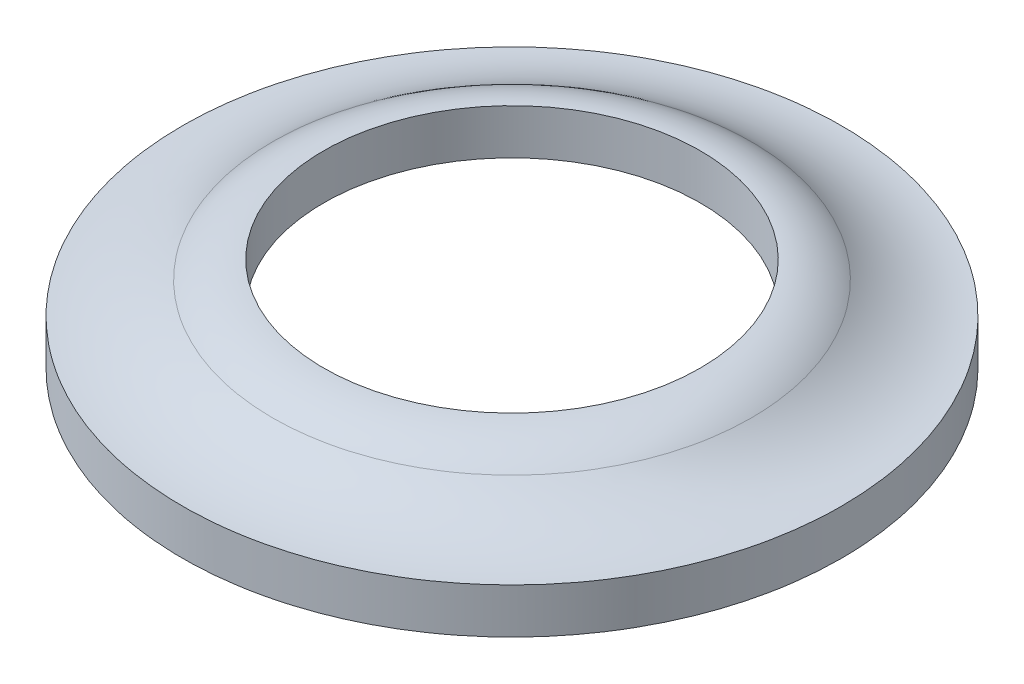
ISO-10303-21;
HEADER;
FILE_DESCRIPTION(('STEP AP214'),'2;1');
FILE_NAME('part.step','',(''),(''),'','','');
FILE_SCHEMA(('AUTOMOTIVE_DESIGN { 1 0 10303 214 1 1 1 1 }'));
ENDSEC;
DATA;
#1=APPLICATION_CONTEXT('core data for automotive mechanical design processes');
#2=APPLICATION_PROTOCOL_DEFINITION('international standard','automotive_design',2000,#1);
#3=PRODUCT_CONTEXT('',#1,'mechanical');
#4=PRODUCT('Part','Part','',(#3));
#5=PRODUCT_RELATED_PRODUCT_CATEGORY('part','',(#4));
#6=PRODUCT_DEFINITION_FORMATION('','',#4);
#7=PRODUCT_DEFINITION_CONTEXT('part definition',#1,'design');
#8=PRODUCT_DEFINITION('design','',#6,#7);
#9=PRODUCT_DEFINITION_SHAPE('','',#8);
#10=(LENGTH_UNIT() NAMED_UNIT(*) SI_UNIT(.MILLI.,.METRE.));
#11=(NAMED_UNIT(*) PLANE_ANGLE_UNIT() SI_UNIT($,.RADIAN.));
#12=(NAMED_UNIT(*) SI_UNIT($,.STERADIAN.) SOLID_ANGLE_UNIT());
#13=UNCERTAINTY_MEASURE_WITH_UNIT(LENGTH_MEASURE(1.E-05),#10,'distance_accuracy_value','');
#14=(GEOMETRIC_REPRESENTATION_CONTEXT(3) GLOBAL_UNCERTAINTY_ASSIGNED_CONTEXT((#13)) GLOBAL_UNIT_ASSIGNED_CONTEXT((#10,
#11,#12)) REPRESENTATION_CONTEXT('',''));
#15=CARTESIAN_POINT('',(0.,0.,0.));
#16=DIRECTION('',(0.,0.,1.));
#17=DIRECTION('',(1.,0.,0.));
#18=AXIS2_PLACEMENT_3D('',#15,#16,#17);
#19=CARTESIAN_POINT('',(1.78174892874158,0.34541037136962,0.));
#20=CARTESIAN_POINT('',(1.7817489287416,0.34541037136962,0.233230384341726));
#21=CARTESIAN_POINT('',(1.73537477134997,0.34541037136962,0.466369017210713));
#22=CARTESIAN_POINT('',(1.55686796332652,0.345410371369634,0.89732257411658));
#23=CARTESIAN_POINT('',(1.42480553623185,0.345410371369648,1.09496796353806));
#24=CARTESIAN_POINT('',(1.0949679635383,0.345410371369592,1.42480553623169));
#25=CARTESIAN_POINT('',(0.897322574116698,0.345410371369648,1.55686796332644));
#26=CARTESIAN_POINT('',(0.466369017210727,0.345410371369592,1.73537477134984));
#27=CARTESIAN_POINT('',(0.233230384341837,0.345410371369731,1.78174892874153));
#28=CARTESIAN_POINT('',(-0.233230384341497,0.345410371369731,1.78174892874158));
#29=CARTESIAN_POINT('',(-0.466369017210394,0.345410371369703,1.73537477134983));
#30=CARTESIAN_POINT('',(-0.897322574116413,0.345410371369703,1.55686796332639));
#31=CARTESIAN_POINT('',(-1.0949679635381,0.345410371369648,1.42480553623175));
#32=CARTESIAN_POINT('',(-1.42480553623146,0.345410371369648,1.09496796353832));
#33=CARTESIAN_POINT('',(-1.55686796332632,0.345410371369717,0.897322574116607));
#34=CARTESIAN_POINT('',(-1.73537477134975,0.345410371369551,0.466369017210574));
#35=CARTESIAN_POINT('',(-1.78174892874129,0.345410371369551,0.233230384341754));
#36=CARTESIAN_POINT('',(-1.78174892874132,0.345410371369551,-0.233230384341587));
#37=CARTESIAN_POINT('',(-1.73537477134969,0.345410371369578,-0.466369017210644));
#38=CARTESIAN_POINT('',(-1.55686796332631,0.345410371369537,-0.897322574116607));
#39=CARTESIAN_POINT('',(-1.42480553623159,0.345410371369537,-1.09496796353824));
#40=CARTESIAN_POINT('',(-1.09496796353814,0.345410371369564,-1.42480553623157));
#41=CARTESIAN_POINT('',(-0.897322574116483,0.34541037136962,-1.55686796332641));
#42=CARTESIAN_POINT('',(-0.466369017210512,0.345410371369523,-1.73537477134993));
#43=CARTESIAN_POINT('',(-0.233230384341546,0.345410371369523,-1.7817489287415));
#44=CARTESIAN_POINT('',(0.233230384341698,0.345410371369523,-1.78174892874156));
#45=CARTESIAN_POINT('',(0.466369017210769,0.345410371369509,-1.73537477135004));
#46=CARTESIAN_POINT('',(0.897322574116816,0.345410371369537,-1.55686796332649));
#47=CARTESIAN_POINT('',(1.09496796353824,0.345410371369606,-1.42480553623169));
#48=CARTESIAN_POINT('',(1.42480553623185,0.345410371369648,-1.09496796353817));
#49=CARTESIAN_POINT('',(1.55686796332663,0.345410371369606,-0.897322574116607));
#50=CARTESIAN_POINT('',(1.73537477135,0.345410371369648,-0.466369017210588));
#51=CARTESIAN_POINT('',(1.78174892874157,0.34541037136962,-0.23323038434174));
#52=CARTESIAN_POINT('',(1.78174892874158,0.34541037136962,0.));
#53=CARTESIAN_POINT('',(2.22006583333348,0.,-1.10160267699312E-13));
#54=CARTESIAN_POINT('',(2.22006583333341,0.,0.290605931744742));
#55=CARTESIAN_POINT('',(2.1622834596703,0.,0.581097540811106));
#56=CARTESIAN_POINT('',(1.93986330881861,-1.39536339085795E-13,1.11806728554163));
#57=CARTESIAN_POINT('',(1.77531303042039,0.,1.36433418044068));
#58=CARTESIAN_POINT('',(1.36433418044109,1.24848303392553E-13,1.77531303042039));
#59=CARTESIAN_POINT('',(1.11806728554205,1.10160267699312E-13,1.93986330881858));
#60=CARTESIAN_POINT('',(0.581097540811268,-1.24848303392553E-13,2.16228345966978));
#61=CARTESIAN_POINT('',(0.290605931744904,-1.10160267699312E-13,2.22006583333324));
#62=CARTESIAN_POINT('',(-0.290605931744566,0.,2.22006583333316));
#63=CARTESIAN_POINT('',(-0.581097540810967,0.,2.16228345966994));
#64=CARTESIAN_POINT('',(-1.11806728554155,0.,1.93986330881855));
#65=CARTESIAN_POINT('',(-1.36433418044093,1.17504285545932E-13,1.77531303042026));
#66=CARTESIAN_POINT('',(-1.77531303042012,0.,1.36433418044065));
#67=CARTESIAN_POINT('',(-1.93986330881846,0.,1.11806728554175));
#68=CARTESIAN_POINT('',(-2.16228345966994,0.,0.581097540811033));
#69=CARTESIAN_POINT('',(-2.22006583333318,0.,0.29060593174461));
#70=CARTESIAN_POINT('',(-2.22006583333326,0.,-0.290605931744816));
#71=CARTESIAN_POINT('',(-2.16228345966983,0.,-0.581097540811121));
#72=CARTESIAN_POINT('',(-1.93986330881854,0.,-1.11806728554192));
#73=CARTESIAN_POINT('',(-1.77531303042013,1.02816249852691E-13,-1.36433418044101));
#74=CARTESIAN_POINT('',(-1.36433418044093,-1.24848303392553E-13,-1.77531303042056));
#75=CARTESIAN_POINT('',(-1.11806728554167,0.,-1.93986330881872));
#76=CARTESIAN_POINT('',(-0.581097540810886,0.,-2.16228345967011));
#77=CARTESIAN_POINT('',(-0.29060593174461,0.,-2.22006583333347));
#78=CARTESIAN_POINT('',(0.290605931744963,0.,-2.22006583333341));
#79=CARTESIAN_POINT('',(0.581097540811444,0.,-2.16228345967038));
#80=CARTESIAN_POINT('',(1.11806728554195,0.,-1.9398633088184));
#81=CARTESIAN_POINT('',(1.36433418044096,1.54224374779036E-13,-1.77531303042056));
#82=CARTESIAN_POINT('',(1.77531303042035,0.,-1.36433418044087));
#83=CARTESIAN_POINT('',(1.93986330881872,0.,-1.11806728554186));
#84=CARTESIAN_POINT('',(2.16228345967022,0.,-0.581097540811253));
#85=CARTESIAN_POINT('',(2.22006583333356,0.,-0.290605931744963));
#86=CARTESIAN_POINT('',(2.22006583333348,0.,-1.10160267699312E-13));
#87=CARTESIAN_POINT('',(2.77812500000008,0.,0.));
#88=CARTESIAN_POINT('',(2.77812500000014,0.,0.363655704261862));
#89=CARTESIAN_POINT('',(2.70581783936397,0.,0.727168348490806));
#90=CARTESIAN_POINT('',(2.42748781315211,0.,1.39911647258782));
#91=CARTESIAN_POINT('',(2.22157444098461,0.,1.70728761198309));
#92=CARTESIAN_POINT('',(1.70728761198323,0.,2.22157444098457));
#93=CARTESIAN_POINT('',(1.39911647258784,0.,2.42748781315183));
#94=CARTESIAN_POINT('',(0.727168348490917,0.,2.70581783936387));
#95=CARTESIAN_POINT('',(0.363655704261834,0.,2.77812499999991));
#96=CARTESIAN_POINT('',(-0.363655704261653,0.,2.77812500000001));
#97=CARTESIAN_POINT('',(-0.727168348490605,0.,2.70581783936402));
#98=CARTESIAN_POINT('',(-1.39911647258757,0.,2.42748781315195));
#99=CARTESIAN_POINT('',(-1.70728761198313,0.,2.22157444098453));
#100=CARTESIAN_POINT('',(-2.22157444098446,0.,1.70728761198322));
#101=CARTESIAN_POINT('',(-2.42748781315193,0.,1.39911647258767));
#102=CARTESIAN_POINT('',(-2.70581783936369,0.,0.727168348490806));
#103=CARTESIAN_POINT('',(-2.7781249999998,0.,0.363655704261709));
#104=CARTESIAN_POINT('',(-2.77812499999985,0.,-0.363655704261778));
#105=CARTESIAN_POINT('',(-2.7058178393638,0.,-0.727168348490931));
#106=CARTESIAN_POINT('',(-2.42748781315175,0.,-1.39911647258777));
#107=CARTESIAN_POINT('',(-2.22157444098429,0.,-1.70728761198315));
#108=CARTESIAN_POINT('',(-1.70728761198324,0.,-2.22157444098467));
#109=CARTESIAN_POINT('',(-1.39911647258759,0.,-2.42748781315195));
#110=CARTESIAN_POINT('',(-0.727168348490834,0.,-2.70581783936394));
#111=CARTESIAN_POINT('',(-0.363655704261528,0.,-2.77812500000003));
#112=CARTESIAN_POINT('',(0.363655704261945,0.,-2.77812499999998));
#113=CARTESIAN_POINT('',(0.727168348490931,0.,-2.70581783936402));
#114=CARTESIAN_POINT('',(1.39911647258782,1.11022302462516E-13,-2.42748781315184));
#115=CARTESIAN_POINT('',(1.7072876119832,1.11022302462516E-13,-2.22157444098456));
#116=CARTESIAN_POINT('',(2.22157444098477,0.,-1.7072876119832));
#117=CARTESIAN_POINT('',(2.42748781315202,0.,-1.39911647258779));
#118=CARTESIAN_POINT('',(2.70581783936413,0.,-0.727168348490723));
#119=CARTESIAN_POINT('',(2.77812500000002,0.,-0.363655704261931));
#120=CARTESIAN_POINT('',(2.77812500000008,0.,0.));
#121=(BOUNDED_SURFACE() B_SPLINE_SURFACE(2,3,((#19,#20,#21,#22,#23,#24,#25,#26,#27,#28,#29,#30,
#31,#32,#33,#34,#35,#36,#37,#38,#39,#40,#41,#42,#43,#44,#45,#46,#47,#48,#49,#50,#51,#52),(#53,
#54,#55,#56,#57,#58,#59,#60,#61,#62,#63,#64,#65,#66,#67,#68,#69,#70,#71,#72,#73,#74,#75,#76,#77,
#78,#79,#80,#81,#82,#83,#84,#85,#86),(#87,#88,#89,#90,#91,#92,#93,#94,#95,#96,#97,#98,#99,#100,
#101,#102,#103,#104,#105,#106,#107,#108,#109,#110,#111,#112,#113,#114,#115,#116,#117,#118,#119,
#120)),.UNSPECIFIED.,.F.,.T.,.F.) B_SPLINE_SURFACE_WITH_KNOTS((3,3),(4,2,2,2,2,2,2,2,2,2,2,2,2,
2,2,2,4),(0.,1.),(-6.28318530717959,-5.89048622548086,-5.49778714378214,-5.10508806208341,
-4.71238898038469,-4.31968989868597,-3.92699081698724,-3.53429173528852,-3.14159265358979,
-2.74889357189107,-2.35619449019234,-1.96349540849362,-1.5707963267949,-1.17809724509617,
-0.785398163397448,-0.392699081698724,0.),
.UNSPECIFIED.) GEOMETRIC_REPRESENTATION_ITEM() RATIONAL_B_SPLINE_SURFACE(((1.,1.,1.,1.,1.,1.,1.,
1.,1.,1.,1.,1.,1.,1.,1.,1.,1.,1.,1.,1.,1.,1.,1.,1.,1.,1.,1.,1.,1.,1.,1.,1.,1.,1.),
(0.944836198498626,0.944836198498626,0.944836198498626,0.944836198498626,0.944836198498626,
0.944836198498626,0.944836198498626,0.944836198498626,0.944836198498626,0.944836198498626,
0.944836198498626,0.944836198498626,0.944836198498625,0.944836198498625,0.944836198498625,
0.944836198498625,0.944836198498625,0.944836198498625,0.944836198498625,0.944836198498625,
0.944836198498625,0.944836198498625,0.944836198498626,0.944836198498626,0.944836198498626,
0.944836198498626,0.944836198498626,0.944836198498626,0.944836198498626,0.944836198498626,
0.944836198498626,0.944836198498626,0.944836198498626,0.944836198498626),(1.,1.,1.,1.,1.,1.,1.,
1.,1.,1.,1.,1.,1.,1.,1.,1.,1.,1.,1.,1.,1.,1.,1.,1.,1.,1.,1.,1.,1.,1.,1.,1.,1.,1.))) REPRESENTATION_ITEM('') SURFACE());
#122=CARTESIAN_POINT('',(2.77812500000008,0.,0.));
#123=CARTESIAN_POINT('',(2.77812500000014,0.,0.363655704261862));
#124=CARTESIAN_POINT('',(2.70581783936397,0.,0.727168348490806));
#125=CARTESIAN_POINT('',(2.42748781315211,0.,1.39911647258782));
#126=CARTESIAN_POINT('',(2.22157444098461,0.,1.70728761198309));
#127=CARTESIAN_POINT('',(1.70728761198323,0.,2.22157444098457));
#128=CARTESIAN_POINT('',(1.39911647258784,0.,2.42748781315183));
#129=CARTESIAN_POINT('',(0.727168348490917,0.,2.70581783936387));
#130=CARTESIAN_POINT('',(0.363655704261834,0.,2.77812499999991));
#131=CARTESIAN_POINT('',(-0.363655704261653,0.,2.77812500000001));
#132=CARTESIAN_POINT('',(-0.727168348490605,0.,2.70581783936402));
#133=CARTESIAN_POINT('',(-1.39911647258757,0.,2.42748781315195));
#134=CARTESIAN_POINT('',(-1.70728761198313,0.,2.22157444098453));
#135=CARTESIAN_POINT('',(-2.22157444098446,0.,1.70728761198322));
#136=CARTESIAN_POINT('',(-2.42748781315193,0.,1.39911647258767));
#137=CARTESIAN_POINT('',(-2.70581783936369,0.,0.727168348490806));
#138=CARTESIAN_POINT('',(-2.7781249999998,0.,0.363655704261709));
#139=CARTESIAN_POINT('',(-2.77812499999985,0.,-0.363655704261778));
#140=CARTESIAN_POINT('',(-2.7058178393638,0.,-0.727168348490931));
#141=CARTESIAN_POINT('',(-2.42748781315175,0.,-1.39911647258777));
#142=CARTESIAN_POINT('',(-2.22157444098429,0.,-1.70728761198315));
#143=CARTESIAN_POINT('',(-1.70728761198324,0.,-2.22157444098467));
#144=CARTESIAN_POINT('',(-1.39911647258759,0.,-2.42748781315195));
#145=CARTESIAN_POINT('',(-0.727168348490834,0.,-2.70581783936394));
#146=CARTESIAN_POINT('',(-0.363655704261528,0.,-2.77812500000003));
#147=CARTESIAN_POINT('',(0.363655704261945,0.,-2.77812499999998));
#148=CARTESIAN_POINT('',(0.727168348490931,0.,-2.70581783936402));
#149=CARTESIAN_POINT('',(1.39911647258782,1.11022302462516E-13,-2.42748781315184));
#150=CARTESIAN_POINT('',(1.7072876119832,1.11022302462516E-13,-2.22157444098456));
#151=CARTESIAN_POINT('',(2.22157444098477,0.,-1.7072876119832));
#152=CARTESIAN_POINT('',(2.42748781315202,0.,-1.39911647258779));
#153=CARTESIAN_POINT('',(2.70581783936413,0.,-0.727168348490723));
#154=CARTESIAN_POINT('',(2.77812500000002,0.,-0.363655704261931));
#155=CARTESIAN_POINT('',(2.77812500000008,0.,0.));
#156=(BOUNDED_CURVE() B_SPLINE_CURVE(3,(#122,#123,#124,#125,#126,#127,#128,#129,#130,#131,#132,
#133,#134,#135,#136,#137,#138,#139,#140,#141,#142,#143,#144,#145,#146,#147,#148,#149,#150,#151,
#152,#153,#154,#155),.UNSPECIFIED.,.T.,.F.) B_SPLINE_CURVE_WITH_KNOTS((4,2,2,2,2,2,2,2,2,2,2,2,
2,2,2,2,4),(-6.28318530717959,-5.89048622548086,-5.49778714378214,-5.10508806208341,
-4.71238898038469,-4.31968989868597,-3.92699081698724,-3.53429173528852,-3.14159265358979,
-2.74889357189107,-2.35619449019234,-1.96349540849362,-1.5707963267949,-1.17809724509617,
-0.785398163397448,-0.392699081698724,0.),
.UNSPECIFIED.) CURVE() GEOMETRIC_REPRESENTATION_ITEM() RATIONAL_B_SPLINE_CURVE((1.,1.,1.,1.,1.,
1.,1.,1.,1.,1.,1.,1.,1.,1.,1.,1.,1.,1.,1.,1.,1.,1.,1.,1.,1.,1.,1.,1.,1.,1.,1.,1.,1.,1.)) REPRESENTATION_ITEM(''));
#157=CARTESIAN_POINT('',(2.77812500000008,0.,0.));
#158=VERTEX_POINT('',#157);
#159=EDGE_CURVE('E76',#158,#158,#156,.T.);
#160=CARTESIAN_POINT('',(1.78174892874158,0.34541037136962,0.));
#161=CARTESIAN_POINT('',(1.78174892874157,0.34541037136962,-0.23323038434174));
#162=CARTESIAN_POINT('',(1.73537477135,0.345410371369648,-0.466369017210588));
#163=CARTESIAN_POINT('',(1.55686796332663,0.345410371369606,-0.897322574116607));
#164=CARTESIAN_POINT('',(1.42480553623185,0.345410371369648,-1.09496796353817));
#165=CARTESIAN_POINT('',(1.09496796353824,0.345410371369606,-1.42480553623169));
#166=CARTESIAN_POINT('',(0.897322574116816,0.345410371369537,-1.55686796332649));
#167=CARTESIAN_POINT('',(0.466369017210769,0.345410371369509,-1.73537477135004));
#168=CARTESIAN_POINT('',(0.233230384341698,0.345410371369523,-1.78174892874156));
#169=CARTESIAN_POINT('',(-0.233230384341546,0.345410371369523,-1.7817489287415));
#170=CARTESIAN_POINT('',(-0.466369017210512,0.345410371369523,-1.73537477134993));
#171=CARTESIAN_POINT('',(-0.897322574116483,0.34541037136962,-1.55686796332641));
#172=CARTESIAN_POINT('',(-1.09496796353814,0.345410371369564,-1.42480553623157));
#173=CARTESIAN_POINT('',(-1.42480553623159,0.345410371369537,-1.09496796353824));
#174=CARTESIAN_POINT('',(-1.55686796332631,0.345410371369537,-0.897322574116607));
#175=CARTESIAN_POINT('',(-1.73537477134969,0.345410371369578,-0.466369017210644));
#176=CARTESIAN_POINT('',(-1.78174892874132,0.345410371369551,-0.233230384341587));
#177=CARTESIAN_POINT('',(-1.78174892874129,0.345410371369551,0.233230384341754));
#178=CARTESIAN_POINT('',(-1.73537477134975,0.345410371369551,0.466369017210574));
#179=CARTESIAN_POINT('',(-1.55686796332632,0.345410371369717,0.897322574116607));
#180=CARTESIAN_POINT('',(-1.42480553623146,0.345410371369648,1.09496796353832));
#181=CARTESIAN_POINT('',(-1.0949679635381,0.345410371369648,1.42480553623175));
#182=CARTESIAN_POINT('',(-0.897322574116413,0.345410371369703,1.55686796332639));
#183=CARTESIAN_POINT('',(-0.466369017210394,0.345410371369703,1.73537477134983));
#184=CARTESIAN_POINT('',(-0.233230384341497,0.345410371369731,1.78174892874158));
#185=CARTESIAN_POINT('',(0.233230384341837,0.345410371369731,1.78174892874153));
#186=CARTESIAN_POINT('',(0.466369017210727,0.345410371369592,1.73537477134984));
#187=CARTESIAN_POINT('',(0.897322574116698,0.345410371369648,1.55686796332644));
#188=CARTESIAN_POINT('',(1.0949679635383,0.345410371369592,1.42480553623169));
#189=CARTESIAN_POINT('',(1.42480553623185,0.345410371369648,1.09496796353806));
#190=CARTESIAN_POINT('',(1.55686796332652,0.345410371369634,0.89732257411658));
#191=CARTESIAN_POINT('',(1.73537477134997,0.34541037136962,0.466369017210713));
#192=CARTESIAN_POINT('',(1.7817489287416,0.34541037136962,0.233230384341726));
#193=CARTESIAN_POINT('',(1.78174892874158,0.34541037136962,0.));
#194=(BOUNDED_CURVE() B_SPLINE_CURVE(3,(#160,#161,#162,#163,#164,#165,#166,#167,#168,#169,#170,
#171,#172,#173,#174,#175,#176,#177,#178,#179,#180,#181,#182,#183,#184,#185,#186,#187,#188,#189,
#190,#191,#192,#193),.UNSPECIFIED.,.T.,.F.) B_SPLINE_CURVE_WITH_KNOTS((4,2,2,2,2,2,2,2,2,2,2,2,
2,2,2,2,4),(-6.28318530717959,-5.89048622548086,-5.49778714378214,-5.10508806208341,
-4.71238898038469,-4.31968989868597,-3.92699081698724,-3.53429173528852,-3.14159265358979,
-2.74889357189107,-2.35619449019234,-1.96349540849362,-1.5707963267949,-1.17809724509617,
-0.785398163397448,-0.392699081698725,0.),
.UNSPECIFIED.) CURVE() GEOMETRIC_REPRESENTATION_ITEM() RATIONAL_B_SPLINE_CURVE((1.,1.,1.,1.,1.,
1.,1.,1.,1.,1.,1.,1.,1.,1.,1.,1.,1.,1.,1.,1.,1.,1.,1.,1.,1.,1.,1.,1.,1.,1.,1.,1.,1.,1.)) REPRESENTATION_ITEM(''));
#195=CARTESIAN_POINT('',(1.78174892874158,0.34541037136962,0.));
#196=VERTEX_POINT('',#195);
#197=EDGE_CURVE('E10',#196,#196,#194,.F.);
#198=ORIENTED_EDGE('',*,*,#159,.T.);
#199=EDGE_LOOP('',(#198));
#200=FACE_BOUND('',#199,.T.);
#201=ORIENTED_EDGE('',*,*,#197,.F.);
#202=EDGE_LOOP('',(#201));
#203=FACE_BOUND('',#202,.T.);
#204=ADVANCED_FACE('F36',(#200,#203),#121,.T.);
#205=CARTESIAN_POINT('',(2.77812500000008,0.381000000000062,0.));
#206=CARTESIAN_POINT('',(2.77812500000014,0.381000000000062,0.363655704261862));
#207=CARTESIAN_POINT('',(2.70581783936395,0.381000000000062,0.727168348490792));
#208=CARTESIAN_POINT('',(2.42748781315211,0.381000000000062,1.39911647258782));
#209=CARTESIAN_POINT('',(2.22157444098461,0.381000000000062,1.70728761198309));
#210=CARTESIAN_POINT('',(1.70728761198323,0.380999999999965,2.22157444098457));
#211=CARTESIAN_POINT('',(1.39911647258789,0.38100000000002,2.42748781315193));
#212=CARTESIAN_POINT('',(0.727168348491042,0.380999999999965,2.70581783936394));
#213=CARTESIAN_POINT('',(0.363655704261806,0.380999999999965,2.77812499999998));
#214=CARTESIAN_POINT('',(-0.363655704261542,0.380999999999965,2.77812500000005));
#215=CARTESIAN_POINT('',(-0.727168348490612,0.380999999999965,2.70581783936404));
#216=CARTESIAN_POINT('',(-1.39911647258749,0.380999999999909,2.42748781315198));
#217=CARTESIAN_POINT('',(-1.7072876119831,0.380999999999909,2.22157444098456));
#218=CARTESIAN_POINT('',(-2.22157444098443,0.381000000000062,1.70728761198323));
#219=CARTESIAN_POINT('',(-2.4274878131519,0.38100000000009,1.39911647258768));
#220=CARTESIAN_POINT('',(-2.70581783936369,0.380999999999909,0.727168348490806));
#221=CARTESIAN_POINT('',(-2.7781249999998,0.380999999999909,0.363655704261751));
#222=CARTESIAN_POINT('',(-2.77812499999983,0.380999999999909,-0.363655704261751));
#223=CARTESIAN_POINT('',(-2.70581783936383,0.380999999999909,-0.727168348490972));
#224=CARTESIAN_POINT('',(-2.42748781315175,0.380999999999909,-1.39911647258777));
#225=CARTESIAN_POINT('',(-2.22157444098429,0.380999999999909,-1.70728761198315));
#226=CARTESIAN_POINT('',(-1.70728761198324,0.381000000000006,-2.22157444098467));
#227=CARTESIAN_POINT('',(-1.39911647258761,0.381000000000006,-2.42748781315193));
#228=CARTESIAN_POINT('',(-0.727168348490792,0.380999999999979,-2.7058178393639));
#229=CARTESIAN_POINT('',(-0.363655704261556,0.381000000000034,-2.77812499999998));
#230=CARTESIAN_POINT('',(0.363655704261848,0.381000000000062,-2.77812500000001));
#231=CARTESIAN_POINT('',(0.727168348490931,0.381000000000062,-2.70581783936401));
#232=CARTESIAN_POINT('',(1.39911647258789,0.381000000000117,-2.42748781315177));
#233=CARTESIAN_POINT('',(1.70728761198333,0.381000000000117,-2.22157444098452));
#234=CARTESIAN_POINT('',(2.22157444098478,0.381000000000062,-1.70728761198315));
#235=CARTESIAN_POINT('',(2.42748781315201,0.381000000000006,-1.39911647258756));
#236=CARTESIAN_POINT('',(2.70581783936412,0.381000000000034,-0.727168348490709));
#237=CARTESIAN_POINT('',(2.77812500000002,0.381000000000062,-0.363655704261931));
#238=CARTESIAN_POINT('',(2.77812500000008,0.381000000000062,0.));
#239=CARTESIAN_POINT('',(2.35214583333335,0.380999999999972,0.));
#240=CARTESIAN_POINT('',(2.3521458333334,0.380999999999972,0.307895162941717));
#241=CARTESIAN_POINT('',(2.29092577066159,0.380999999999913,0.615669201722268));
#242=CARTESIAN_POINT('',(2.05527301513525,0.381000000000089,1.1845852801242));
#243=CARTESIAN_POINT('',(1.88093302670034,0.381000000000045,1.44550351147894));
#244=CARTESIAN_POINT('',(1.4455035114792,0.381000000000016,1.88093302670023));
#245=CARTESIAN_POINT('',(1.18458528012432,0.38100000000006,2.05527301513535));
#246=CARTESIAN_POINT('',(0.615669201722202,0.380999999999957,2.29092577066132));
#247=CARTESIAN_POINT('',(0.307895162941761,0.381000000000023,2.35214583333319));
#248=CARTESIAN_POINT('',(-0.307895162941438,0.380999999999979,2.35214583333335));
#249=CARTESIAN_POINT('',(-0.615669201722136,0.381000000000038,2.29092577066143));
#250=CARTESIAN_POINT('',(-1.18458528012416,0.381000000000111,2.05527301513515));
#251=CARTESIAN_POINT('',(-1.44550351147899,0.381000000000185,1.8809330267002));
#252=CARTESIAN_POINT('',(-1.88093302670001,0.381000000000111,1.44550351147897));
#253=CARTESIAN_POINT('',(-2.0552730151352,0.381000000000023,1.1845852801241));
#254=CARTESIAN_POINT('',(-2.29092577066126,0.38100000000017,0.615669201722077));
#255=CARTESIAN_POINT('',(-2.35214583333319,0.381000000000097,0.307895162941497));
#256=CARTESIAN_POINT('',(-2.35214583333322,0.381000000000141,-0.307895162941732));
#257=CARTESIAN_POINT('',(-2.29092577066125,0.381000000000067,-0.615669201722312));
#258=CARTESIAN_POINT('',(-2.05527301513519,0.381000000000097,-1.18458528012426));
#259=CARTESIAN_POINT('',(-1.88093302670015,0.381000000000141,-1.44550351147914));
#260=CARTESIAN_POINT('',(-1.44550351147902,0.381000000000023,-1.88093302670026));
#261=CARTESIAN_POINT('',(-1.18458528012431,0.381000000000016,-2.05527301513541));
#262=CARTESIAN_POINT('',(-0.615669201722173,0.381000000000031,-2.29092577066123));
#263=CARTESIAN_POINT('',(-0.307895162941482,0.381000000000126,-2.35214583333348));
#264=CARTESIAN_POINT('',(0.307895162941747,0.38100000000017,-2.35214583333345));
#265=CARTESIAN_POINT('',(0.615669201722371,0.381000000000104,-2.29092577066148));
#266=CARTESIAN_POINT('',(1.18458528012425,0.380999999999913,-2.05527301513522));
#267=CARTESIAN_POINT('',(1.44550351147906,0.380999999999987,-1.88093302670034));
#268=CARTESIAN_POINT('',(1.88093302670037,0.380999999999957,-1.44550351147908));
#269=CARTESIAN_POINT('',(2.05527301513537,0.380999999999928,-1.18458528012428));
#270=CARTESIAN_POINT('',(2.29092577066152,0.381000000000016,-0.615669201722121));
#271=CARTESIAN_POINT('',(2.35214583333331,0.380999999999972,-0.307895162941688));
#272=CARTESIAN_POINT('',(2.35214583333335,0.380999999999972,0.));
#273=CARTESIAN_POINT('',(2.0175686398986,0.644659538168529,0.));
#274=CARTESIAN_POINT('',(2.01756863989863,0.644659538168516,0.264099111681029));
#275=CARTESIAN_POINT('',(1.96505672638164,0.644659538168502,0.528094328312065));
#276=CARTESIAN_POINT('',(1.76292401729622,0.644659538168585,1.01608585598496));
#277=CARTESIAN_POINT('',(1.61338273955662,0.644659538168529,1.23989019400644));
#278=CARTESIAN_POINT('',(1.23989019400664,0.644659538168543,1.61338273955651));
#279=CARTESIAN_POINT('',(1.01608585598509,0.644659538168627,1.762924017296));
#280=CARTESIAN_POINT('',(0.52809432831219,0.644659538168529,1.96505672638154));
#281=CARTESIAN_POINT('',(0.264099111681015,0.644659538168599,2.01756863989838));
#282=CARTESIAN_POINT('',(-0.264099111680821,0.644659538168654,2.01756863989833));
#283=CARTESIAN_POINT('',(-0.52809432831194,0.644659538168654,1.96505672638141));
#284=CARTESIAN_POINT('',(-1.01608585598487,0.644659538168599,1.76292401729608));
#285=CARTESIAN_POINT('',(-1.23989019400651,0.644659538168529,1.61338273955662));
#286=CARTESIAN_POINT('',(-1.61338273955641,0.64465953816871,1.2398901940064));
#287=CARTESIAN_POINT('',(-1.76292401729596,0.64465953816864,1.01608585598492));
#288=CARTESIAN_POINT('',(-1.96505672638141,0.644659538168432,0.528094328312093));
#289=CARTESIAN_POINT('',(-2.01756863989835,0.644659538168474,0.264099111681015));
#290=CARTESIAN_POINT('',(-2.01756863989831,0.644659538168446,-0.264099111681085));
#291=CARTESIAN_POINT('',(-1.96505672638128,0.644659538168488,-0.528094328312023));
#292=CARTESIAN_POINT('',(-1.76292401729618,0.644659538168404,-1.01608585598502));
#293=CARTESIAN_POINT('',(-1.61338273955632,0.644659538168418,-1.2398901940065));
#294=CARTESIAN_POINT('',(-1.2398901940065,0.64465953816846,-1.61338273955644));
#295=CARTESIAN_POINT('',(-1.01608585598481,0.644659538168474,-1.76292401729618));
#296=CARTESIAN_POINT('',(-0.528094328312058,0.644659538168502,-1.96505672638142));
#297=CARTESIAN_POINT('',(-0.26409911168096,0.644659538168502,-2.01756863989842));
#298=CARTESIAN_POINT('',(0.264099111681126,0.644659538168446,-2.01756863989842));
#299=CARTESIAN_POINT('',(0.528094328312148,0.644659538168543,-1.96505672638139));
#300=CARTESIAN_POINT('',(1.01608585598503,0.644659538168404,-1.76292401729632));
#301=CARTESIAN_POINT('',(1.23989019400647,0.644659538168516,-1.61338273955652));
#302=CARTESIAN_POINT('',(1.61338273955663,0.644659538168543,-1.23989019400644));
#303=CARTESIAN_POINT('',(1.76292401729637,0.644659538168516,-1.01608585598488));
#304=CARTESIAN_POINT('',(1.96505672638145,0.644659538168571,-0.528094328312162));
#305=CARTESIAN_POINT('',(2.01756863989858,0.644659538168543,-0.264099111681113));
#306=CARTESIAN_POINT('',(2.0175686398986,0.644659538168529,0.));
#307=(BOUNDED_SURFACE() B_SPLINE_SURFACE(2,3,((#205,#206,#207,#208,#209,#210,#211,#212,#213,
#214,#215,#216,#217,#218,#219,#220,#221,#222,#223,#224,#225,#226,#227,#228,#229,#230,#231,#232,
#233,#234,#235,#236,#237,#238),(#239,#240,#241,#242,#243,#244,#245,#246,#247,#248,#249,#250,
#251,#252,#253,#254,#255,#256,#257,#258,#259,#260,#261,#262,#263,#264,#265,#266,#267,#268,#269,
#270,#271,#272),(#273,#274,#275,#276,#277,#278,#279,#280,#281,#282,#283,#284,#285,#286,#287,
#288,#289,#290,#291,#292,#293,#294,#295,#296,#297,#298,#299,#300,#301,#302,#303,#304,#305,
#306)),.UNSPECIFIED.,.F.,.T.,.F.) B_SPLINE_SURFACE_WITH_KNOTS((3,3),(4,2,2,2,2,2,2,2,2,2,2,2,2,
2,2,2,4),(0.,1.),(-6.28318530717959,-5.89048622548086,-5.49778714378214,-5.10508806208341,
-4.71238898038469,-4.31968989868597,-3.92699081698724,-3.53429173528852,-3.14159265358979,
-2.74889357189107,-2.35619449019234,-1.96349540849362,-1.5707963267949,-1.17809724509617,
-0.785398163397448,-0.392699081698724,0.),
.UNSPECIFIED.) GEOMETRIC_REPRESENTATION_ITEM() RATIONAL_B_SPLINE_SURFACE(((1.,1.,1.,1.,1.,1.,1.,
1.,1.,1.,1.,1.,1.,1.,1.,1.,1.,1.,1.,1.,1.,1.,1.,1.,1.,1.,1.,1.,1.,1.,1.,1.,1.,1.),
(0.944836198498626,0.944836198498626,0.944836198498626,0.944836198498626,0.944836198498626,
0.944836198498626,0.944836198498626,0.944836198498626,0.944836198498626,0.944836198498626,
0.944836198498626,0.944836198498626,0.944836198498626,0.944836198498626,0.944836198498626,
0.944836198498626,0.944836198498626,0.944836198498626,0.944836198498626,0.944836198498626,
0.944836198498626,0.944836198498626,0.944836198498626,0.944836198498626,0.944836198498626,
0.944836198498626,0.944836198498626,0.944836198498626,0.944836198498626,0.944836198498626,
0.944836198498626,0.944836198498626,0.944836198498626,0.944836198498626),(1.,1.,1.,1.,1.,1.,1.,
1.,1.,1.,1.,1.,1.,1.,1.,1.,1.,1.,1.,1.,1.,1.,1.,1.,1.,1.,1.,1.,1.,1.,1.,1.,1.,1.))) REPRESENTATION_ITEM('') SURFACE());
#308=CARTESIAN_POINT('',(2.77812500000008,0.381000000000062,0.));
#309=CARTESIAN_POINT('',(2.77812500000002,0.381000000000062,-0.363655704261931));
#310=CARTESIAN_POINT('',(2.70581783936412,0.381000000000034,-0.727168348490709));
#311=CARTESIAN_POINT('',(2.42748781315201,0.381000000000006,-1.39911647258756));
#312=CARTESIAN_POINT('',(2.22157444098478,0.381000000000062,-1.70728761198315));
#313=CARTESIAN_POINT('',(1.70728761198333,0.381000000000117,-2.22157444098452));
#314=CARTESIAN_POINT('',(1.39911647258789,0.381000000000117,-2.42748781315177));
#315=CARTESIAN_POINT('',(0.727168348490931,0.381000000000062,-2.70581783936401));
#316=CARTESIAN_POINT('',(0.363655704261848,0.381000000000062,-2.77812500000001));
#317=CARTESIAN_POINT('',(-0.363655704261556,0.381000000000034,-2.77812499999998));
#318=CARTESIAN_POINT('',(-0.727168348490792,0.380999999999979,-2.7058178393639));
#319=CARTESIAN_POINT('',(-1.39911647258761,0.381000000000006,-2.42748781315193));
#320=CARTESIAN_POINT('',(-1.70728761198324,0.381000000000006,-2.22157444098467));
#321=CARTESIAN_POINT('',(-2.22157444098429,0.380999999999909,-1.70728761198315));
#322=CARTESIAN_POINT('',(-2.42748781315175,0.380999999999909,-1.39911647258777));
#323=CARTESIAN_POINT('',(-2.70581783936383,0.380999999999909,-0.727168348490972));
#324=CARTESIAN_POINT('',(-2.77812499999983,0.380999999999909,-0.363655704261751));
#325=CARTESIAN_POINT('',(-2.7781249999998,0.380999999999909,0.363655704261751));
#326=CARTESIAN_POINT('',(-2.70581783936369,0.380999999999909,0.727168348490806));
#327=CARTESIAN_POINT('',(-2.4274878131519,0.38100000000009,1.39911647258768));
#328=CARTESIAN_POINT('',(-2.22157444098443,0.381000000000062,1.70728761198323));
#329=CARTESIAN_POINT('',(-1.7072876119831,0.380999999999909,2.22157444098456));
#330=CARTESIAN_POINT('',(-1.39911647258749,0.380999999999909,2.42748781315198));
#331=CARTESIAN_POINT('',(-0.727168348490612,0.380999999999965,2.70581783936404));
#332=CARTESIAN_POINT('',(-0.363655704261542,0.380999999999965,2.77812500000005));
#333=CARTESIAN_POINT('',(0.363655704261806,0.380999999999965,2.77812499999998));
#334=CARTESIAN_POINT('',(0.727168348491042,0.380999999999965,2.70581783936394));
#335=CARTESIAN_POINT('',(1.39911647258789,0.38100000000002,2.42748781315193));
#336=CARTESIAN_POINT('',(1.70728761198323,0.380999999999965,2.22157444098457));
#337=CARTESIAN_POINT('',(2.22157444098461,0.381000000000062,1.70728761198309));
#338=CARTESIAN_POINT('',(2.42748781315211,0.381000000000062,1.39911647258782));
#339=CARTESIAN_POINT('',(2.70581783936395,0.381000000000062,0.727168348490792));
#340=CARTESIAN_POINT('',(2.77812500000014,0.381000000000062,0.363655704261862));
#341=CARTESIAN_POINT('',(2.77812500000008,0.381000000000062,0.));
#342=(BOUNDED_CURVE() B_SPLINE_CURVE(3,(#308,#309,#310,#311,#312,#313,#314,#315,#316,#317,#318,
#319,#320,#321,#322,#323,#324,#325,#326,#327,#328,#329,#330,#331,#332,#333,#334,#335,#336,#337,
#338,#339,#340,#341),.UNSPECIFIED.,.T.,.F.) B_SPLINE_CURVE_WITH_KNOTS((4,2,2,2,2,2,2,2,2,2,2,2,
2,2,2,2,4),(-6.28318530717959,-5.89048622548086,-5.49778714378214,-5.10508806208341,
-4.71238898038469,-4.31968989868597,-3.92699081698724,-3.53429173528852,-3.14159265358979,
-2.74889357189107,-2.35619449019234,-1.96349540849362,-1.5707963267949,-1.17809724509617,
-0.785398163397448,-0.392699081698725,0.),
.UNSPECIFIED.) CURVE() GEOMETRIC_REPRESENTATION_ITEM() RATIONAL_B_SPLINE_CURVE((1.,1.,1.,1.,1.,
1.,1.,1.,1.,1.,1.,1.,1.,1.,1.,1.,1.,1.,1.,1.,1.,1.,1.,1.,1.,1.,1.,1.,1.,1.,1.,1.,1.,1.)) REPRESENTATION_ITEM(''));
#343=CARTESIAN_POINT('',(2.77812500000008,0.381000000000062,0.));
#344=VERTEX_POINT('',#343);
#345=EDGE_CURVE('E55',#344,#344,#342,.F.);
#346=CARTESIAN_POINT('',(2.0175686398986,0.644659538168529,0.));
#347=CARTESIAN_POINT('',(2.01756863989863,0.644659538168516,0.264099111681029));
#348=CARTESIAN_POINT('',(1.96505672638164,0.644659538168502,0.528094328312065));
#349=CARTESIAN_POINT('',(1.76292401729622,0.644659538168585,1.01608585598496));
#350=CARTESIAN_POINT('',(1.61338273955662,0.644659538168529,1.23989019400644));
#351=CARTESIAN_POINT('',(1.23989019400664,0.644659538168543,1.61338273955651));
#352=CARTESIAN_POINT('',(1.01608585598509,0.644659538168627,1.762924017296));
#353=CARTESIAN_POINT('',(0.52809432831219,0.644659538168529,1.96505672638154));
#354=CARTESIAN_POINT('',(0.264099111681015,0.644659538168599,2.01756863989838));
#355=CARTESIAN_POINT('',(-0.264099111680821,0.644659538168654,2.01756863989833));
#356=CARTESIAN_POINT('',(-0.52809432831194,0.644659538168654,1.96505672638141));
#357=CARTESIAN_POINT('',(-1.01608585598487,0.644659538168599,1.76292401729608));
#358=CARTESIAN_POINT('',(-1.23989019400651,0.644659538168529,1.61338273955662));
#359=CARTESIAN_POINT('',(-1.61338273955641,0.64465953816871,1.2398901940064));
#360=CARTESIAN_POINT('',(-1.76292401729596,0.64465953816864,1.01608585598492));
#361=CARTESIAN_POINT('',(-1.96505672638141,0.644659538168432,0.528094328312093));
#362=CARTESIAN_POINT('',(-2.01756863989835,0.644659538168474,0.264099111681015));
#363=CARTESIAN_POINT('',(-2.01756863989831,0.644659538168446,-0.264099111681085));
#364=CARTESIAN_POINT('',(-1.96505672638128,0.644659538168488,-0.528094328312023));
#365=CARTESIAN_POINT('',(-1.76292401729618,0.644659538168404,-1.01608585598502));
#366=CARTESIAN_POINT('',(-1.61338273955632,0.644659538168418,-1.2398901940065));
#367=CARTESIAN_POINT('',(-1.2398901940065,0.64465953816846,-1.61338273955644));
#368=CARTESIAN_POINT('',(-1.01608585598481,0.644659538168474,-1.76292401729618));
#369=CARTESIAN_POINT('',(-0.528094328312058,0.644659538168502,-1.96505672638142));
#370=CARTESIAN_POINT('',(-0.26409911168096,0.644659538168502,-2.01756863989842));
#371=CARTESIAN_POINT('',(0.264099111681126,0.644659538168446,-2.01756863989842));
#372=CARTESIAN_POINT('',(0.528094328312148,0.644659538168543,-1.96505672638139));
#373=CARTESIAN_POINT('',(1.01608585598503,0.644659538168404,-1.76292401729632));
#374=CARTESIAN_POINT('',(1.23989019400647,0.644659538168516,-1.61338273955652));
#375=CARTESIAN_POINT('',(1.61338273955663,0.644659538168543,-1.23989019400644));
#376=CARTESIAN_POINT('',(1.76292401729637,0.644659538168516,-1.01608585598488));
#377=CARTESIAN_POINT('',(1.96505672638145,0.644659538168571,-0.528094328312162));
#378=CARTESIAN_POINT('',(2.01756863989858,0.644659538168543,-0.264099111681113));
#379=CARTESIAN_POINT('',(2.0175686398986,0.644659538168529,0.));
#380=(BOUNDED_CURVE() B_SPLINE_CURVE(3,(#346,#347,#348,#349,#350,#351,#352,#353,#354,#355,#356,
#357,#358,#359,#360,#361,#362,#363,#364,#365,#366,#367,#368,#369,#370,#371,#372,#373,#374,#375,
#376,#377,#378,#379),.UNSPECIFIED.,.T.,.F.) B_SPLINE_CURVE_WITH_KNOTS((4,2,2,2,2,2,2,2,2,2,2,2,
2,2,2,2,4),(-6.28318530717959,-5.89048622548086,-5.49778714378214,-5.10508806208341,
-4.71238898038469,-4.31968989868597,-3.92699081698724,-3.53429173528852,-3.14159265358979,
-2.74889357189107,-2.35619449019234,-1.96349540849362,-1.5707963267949,-1.17809724509617,
-0.785398163397448,-0.392699081698724,0.),
.UNSPECIFIED.) CURVE() GEOMETRIC_REPRESENTATION_ITEM() RATIONAL_B_SPLINE_CURVE((1.,1.,1.,1.,1.,
1.,1.,1.,1.,1.,1.,1.,1.,1.,1.,1.,1.,1.,1.,1.,1.,1.,1.,1.,1.,1.,1.,1.,1.,1.,1.,1.,1.,1.)) REPRESENTATION_ITEM(''));
#381=CARTESIAN_POINT('',(2.0175686398986,0.644659538168529,0.));
#382=VERTEX_POINT('',#381);
#383=EDGE_CURVE('E48',#382,#382,#380,.F.);
#384=ORIENTED_EDGE('',*,*,#345,.F.);
#385=EDGE_LOOP('',(#384));
#386=FACE_BOUND('',#385,.T.);
#387=ORIENTED_EDGE('',*,*,#383,.F.);
#388=EDGE_LOOP('',(#387));
#389=FACE_BOUND('',#388,.T.);
#390=ADVANCED_FACE('F99',(#386,#389),#307,.T.);
#391=CARTESIAN_POINT('',(0.,0.,0.));
#392=DIRECTION('',(0.,-1.,0.));
#393=DIRECTION('',(1.,0.,0.));
#394=AXIS2_PLACEMENT_3D('',#391,#392,#393);
#395=CYLINDRICAL_SURFACE('',#394,2.778125);
#396=ORIENTED_EDGE('',*,*,#159,.F.);
#397=EDGE_LOOP('',(#396));
#398=FACE_BOUND('',#397,.T.);
#399=ORIENTED_EDGE('',*,*,#345,.T.);
#400=EDGE_LOOP('',(#399));
#401=FACE_BOUND('',#400,.T.);
#402=ADVANCED_FACE('F95',(#398,#401),#395,.T.);
#403=CARTESIAN_POINT('',(0.,0.0989134615384663,0.));
#404=DIRECTION('',(0.,-1.,0.));
#405=DIRECTION('',(1.,0.,0.));
#406=AXIS2_PLACEMENT_3D('',#403,#404,#405);
#407=TOROIDAL_SURFACE('',#406,1.5875,0.694836538461539);
#408=ORIENTED_EDGE('',*,*,#383,.T.);
#409=EDGE_LOOP('',(#408));
#410=FACE_BOUND('',#409,.T.);
#411=CARTESIAN_POINT('',(0.,0.793749999999996,0.));
#412=DIRECTION('',(0.,-1.,0.));
#413=DIRECTION('',(1.,0.,0.));
#414=AXIS2_PLACEMENT_3D('',#411,#412,#413);
#415=CIRCLE('',#414,1.5875);
#416=CARTESIAN_POINT('',(1.58749999999999,0.793749999999996,0.));
#417=VERTEX_POINT('',#416);
#418=EDGE_CURVE('E62',#417,#417,#415,.T.);
#419=ORIENTED_EDGE('',*,*,#418,.T.);
#420=EDGE_LOOP('',(#419));
#421=FACE_BOUND('',#420,.T.);
#422=ADVANCED_FACE('F84',(#410,#421),#407,.T.);
#423=CARTESIAN_POINT('',(0.,0.,0.));
#424=DIRECTION('',(0.,-1.,0.));
#425=DIRECTION('',(1.,0.,0.));
#426=AXIS2_PLACEMENT_3D('',#423,#424,#425);
#427=CYLINDRICAL_SURFACE('',#426,1.5875);
#428=ORIENTED_EDGE('',*,*,#418,.F.);
#429=EDGE_LOOP('',(#428));
#430=FACE_BOUND('',#429,.T.);
#431=CARTESIAN_POINT('',(0.,0.412750000000003,0.));
#432=DIRECTION('',(0.,-1.,0.));
#433=DIRECTION('',(1.,0.,0.));
#434=AXIS2_PLACEMENT_3D('',#431,#432,#433);
#435=CIRCLE('',#434,1.5875);
#436=CARTESIAN_POINT('',(1.58750000000001,0.412750000000004,0.));
#437=VERTEX_POINT('',#436);
#438=EDGE_CURVE('E69',#437,#437,#435,.T.);
#439=ORIENTED_EDGE('',*,*,#438,.T.);
#440=EDGE_LOOP('',(#439));
#441=FACE_BOUND('',#440,.T.);
#442=ADVANCED_FACE('F94',(#430,#441),#427,.F.);
#443=CARTESIAN_POINT('',(0.,0.0989134615384663,0.));
#444=DIRECTION('',(0.,-1.,0.));
#445=DIRECTION('',(1.,0.,0.));
#446=AXIS2_PLACEMENT_3D('',#443,#444,#445);
#447=TOROIDAL_SURFACE('',#446,1.5875,0.313836538461539);
#448=ORIENTED_EDGE('',*,*,#197,.T.);
#449=EDGE_LOOP('',(#448));
#450=FACE_BOUND('',#449,.T.);
#451=ORIENTED_EDGE('',*,*,#438,.F.);
#452=EDGE_LOOP('',(#451));
#453=FACE_BOUND('',#452,.T.);
#454=ADVANCED_FACE('F141',(#450,#453),#447,.F.);
#455=CLOSED_SHELL('',(#204,#390,#402,#422,#442,#454));
#456=MANIFOLD_SOLID_BREP('B2',#455);
#457=ADVANCED_BREP_SHAPE_REPRESENTATION('',(#18,#456),#14);
#458=SHAPE_DEFINITION_REPRESENTATION(#9,#457);
ENDSEC;
END-ISO-10303-21;
